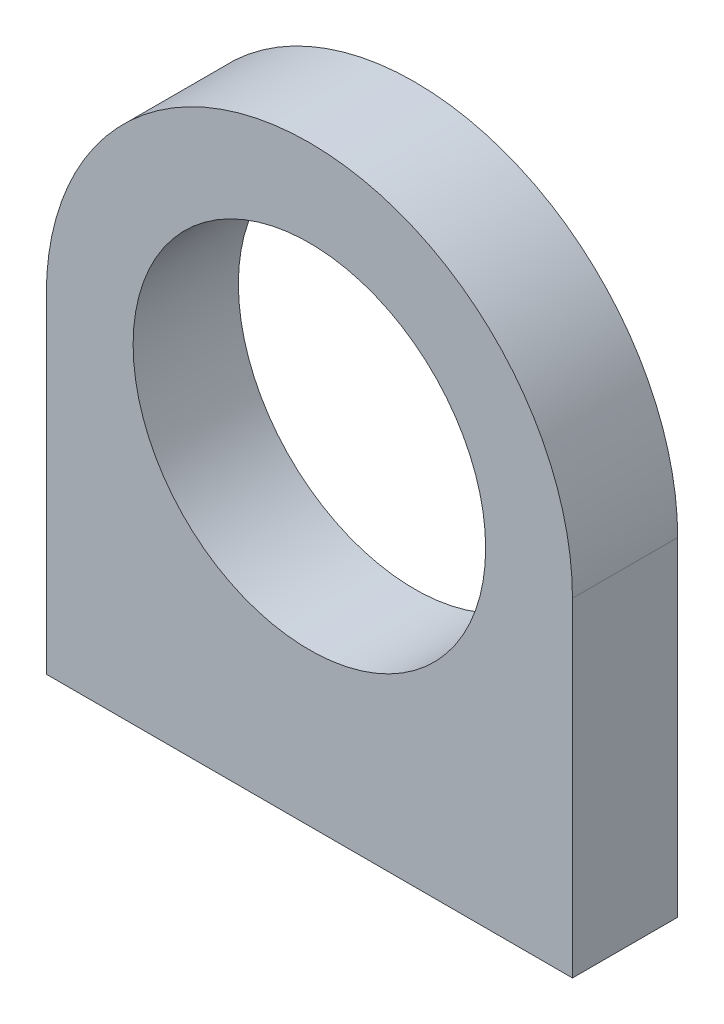
ISO-10303-21;
HEADER;
FILE_DESCRIPTION(('STEP AP214'),'2;1');
FILE_NAME('part.step','',(''),(''),'','','');
FILE_SCHEMA(('AUTOMOTIVE_DESIGN { 1 0 10303 214 1 1 1 1 }'));
ENDSEC;
DATA;
#1=APPLICATION_CONTEXT('core data for automotive mechanical design processes');
#2=APPLICATION_PROTOCOL_DEFINITION('international standard','automotive_design',2000,#1);
#3=PRODUCT_CONTEXT('',#1,'mechanical');
#4=PRODUCT('Part','Part','',(#3));
#5=PRODUCT_RELATED_PRODUCT_CATEGORY('part','',(#4));
#6=PRODUCT_DEFINITION_FORMATION('','',#4);
#7=PRODUCT_DEFINITION_CONTEXT('part definition',#1,'design');
#8=PRODUCT_DEFINITION('design','',#6,#7);
#9=PRODUCT_DEFINITION_SHAPE('','',#8);
#10=(LENGTH_UNIT() NAMED_UNIT(*) SI_UNIT(.MILLI.,.METRE.));
#11=(NAMED_UNIT(*) PLANE_ANGLE_UNIT() SI_UNIT($,.RADIAN.));
#12=(NAMED_UNIT(*) SI_UNIT($,.STERADIAN.) SOLID_ANGLE_UNIT());
#13=UNCERTAINTY_MEASURE_WITH_UNIT(LENGTH_MEASURE(1.E-05),#10,'distance_accuracy_value','');
#14=(GEOMETRIC_REPRESENTATION_CONTEXT(3) GLOBAL_UNCERTAINTY_ASSIGNED_CONTEXT((#13)) GLOBAL_UNIT_ASSIGNED_CONTEXT((#10,
#11,#12)) REPRESENTATION_CONTEXT('',''));
#15=CARTESIAN_POINT('',(0.,0.,0.));
#16=DIRECTION('',(0.,0.,1.));
#17=DIRECTION('',(1.,0.,0.));
#18=AXIS2_PLACEMENT_3D('',#15,#16,#17);
#19=CARTESIAN_POINT('',(0.,0.,8.));
#20=DIRECTION('',(0.,0.,-1.));
#21=DIRECTION('',(-1.,0.,0.));
#22=AXIS2_PLACEMENT_3D('',#19,#20,#21);
#23=PLANE('',#22);
#24=CARTESIAN_POINT('',(0.,0.,8.));
#25=DIRECTION('',(0.,0.,1.));
#26=DIRECTION('',(1.,0.,0.));
#27=AXIS2_PLACEMENT_3D('',#24,#25,#26);
#28=CIRCLE('',#27,13.4);
#29=CARTESIAN_POINT('',(13.4,0.,8.));
#30=VERTEX_POINT('',#29);
#31=EDGE_CURVE('E148',#30,#30,#28,.T.);
#32=ORIENTED_EDGE('',*,*,#31,.F.);
#33=EDGE_LOOP('',(#32));
#34=FACE_BOUND('',#33,.T.);
#35=CARTESIAN_POINT('',(0.,0.,8.));
#36=DIRECTION('',(0.,0.,1.));
#37=DIRECTION('',(-1.,0.,0.));
#38=AXIS2_PLACEMENT_3D('',#35,#36,#37);
#39=CIRCLE('',#38,20.);
#40=CARTESIAN_POINT('',(20.,0.,8.));
#41=VERTEX_POINT('',#40);
#42=CARTESIAN_POINT('',(-20.,0.,8.));
#43=VERTEX_POINT('',#42);
#44=EDGE_CURVE('E94',#41,#43,#39,.T.);
#45=ORIENTED_EDGE('',*,*,#44,.T.);
#46=DIRECTION('',(0.,-1.,0.));
#47=VECTOR('',#46,1.);
#48=CARTESIAN_POINT('',(-20.,0.,8.));
#49=LINE('',#48,#47);
#50=CARTESIAN_POINT('',(-20.,-25.,8.));
#51=VERTEX_POINT('',#50);
#52=EDGE_CURVE('E90',#43,#51,#49,.T.);
#53=ORIENTED_EDGE('',*,*,#52,.T.);
#54=DIRECTION('',(1.,0.,0.));
#55=VECTOR('',#54,1.);
#56=CARTESIAN_POINT('',(-20.,-25.,8.));
#57=LINE('',#56,#55);
#58=CARTESIAN_POINT('',(20.,-25.,8.));
#59=VERTEX_POINT('',#58);
#60=EDGE_CURVE('E92',#51,#59,#57,.T.);
#61=ORIENTED_EDGE('',*,*,#60,.T.);
#62=DIRECTION('',(0.,1.,0.));
#63=VECTOR('',#62,1.);
#64=CARTESIAN_POINT('',(20.,0.,8.));
#65=LINE('',#64,#63);
#66=EDGE_CURVE('E59',#59,#41,#65,.T.);
#67=ORIENTED_EDGE('',*,*,#66,.T.);
#68=EDGE_LOOP('',(#45,#53,#61,#67));
#69=FACE_BOUND('',#68,.T.);
#70=ADVANCED_FACE('F41',(#34,#69),#23,.F.);
#71=CARTESIAN_POINT('',(0.,0.,0.));
#72=DIRECTION('',(0.,0.,-1.));
#73=DIRECTION('',(-1.,0.,0.));
#74=AXIS2_PLACEMENT_3D('',#71,#72,#73);
#75=PLANE('',#74);
#76=CARTESIAN_POINT('',(0.,0.,0.));
#77=DIRECTION('',(0.,0.,1.));
#78=DIRECTION('',(1.,0.,0.));
#79=AXIS2_PLACEMENT_3D('',#76,#77,#78);
#80=CIRCLE('',#79,13.4);
#81=CARTESIAN_POINT('',(13.4,0.,0.));
#82=VERTEX_POINT('',#81);
#83=EDGE_CURVE('E112',#82,#82,#80,.T.);
#84=ORIENTED_EDGE('',*,*,#83,.T.);
#85=EDGE_LOOP('',(#84));
#86=FACE_BOUND('',#85,.T.);
#87=CARTESIAN_POINT('',(0.,0.,0.));
#88=DIRECTION('',(0.,0.,1.));
#89=DIRECTION('',(-1.,0.,0.));
#90=AXIS2_PLACEMENT_3D('',#87,#88,#89);
#91=CIRCLE('',#90,20.);
#92=CARTESIAN_POINT('',(20.,0.,0.));
#93=VERTEX_POINT('',#92);
#94=CARTESIAN_POINT('',(-20.,0.,0.));
#95=VERTEX_POINT('',#94);
#96=EDGE_CURVE('E109',#93,#95,#91,.T.);
#97=ORIENTED_EDGE('',*,*,#96,.F.);
#98=DIRECTION('',(0.,1.,0.));
#99=VECTOR('',#98,1.);
#100=CARTESIAN_POINT('',(20.,0.,0.));
#101=LINE('',#100,#99);
#102=CARTESIAN_POINT('',(20.,-25.,0.));
#103=VERTEX_POINT('',#102);
#104=EDGE_CURVE('E82',#103,#93,#101,.T.);
#105=ORIENTED_EDGE('',*,*,#104,.F.);
#106=DIRECTION('',(1.,0.,0.));
#107=VECTOR('',#106,1.);
#108=CARTESIAN_POINT('',(-20.,-25.,0.));
#109=LINE('',#108,#107);
#110=CARTESIAN_POINT('',(-20.,-25.,0.));
#111=VERTEX_POINT('',#110);
#112=EDGE_CURVE('E76',#111,#103,#109,.T.);
#113=ORIENTED_EDGE('',*,*,#112,.F.);
#114=DIRECTION('',(0.,-1.,0.));
#115=VECTOR('',#114,1.);
#116=CARTESIAN_POINT('',(-20.,0.,0.));
#117=LINE('',#116,#115);
#118=EDGE_CURVE('E99',#95,#111,#117,.T.);
#119=ORIENTED_EDGE('',*,*,#118,.F.);
#120=EDGE_LOOP('',(#97,#105,#113,#119));
#121=FACE_BOUND('',#120,.T.);
#122=ADVANCED_FACE('F158',(#86,#121),#75,.T.);
#123=CARTESIAN_POINT('',(0.,0.,8.));
#124=DIRECTION('',(0.,0.,-1.));
#125=DIRECTION('',(-1.,0.,0.));
#126=AXIS2_PLACEMENT_3D('',#123,#124,#125);
#127=CYLINDRICAL_SURFACE('',#126,20.);
#128=ORIENTED_EDGE('',*,*,#96,.T.);
#129=DIRECTION('',(0.,0.,-1.));
#130=VECTOR('',#129,1.);
#131=CARTESIAN_POINT('',(-20.,0.,8.));
#132=LINE('',#131,#130);
#133=EDGE_CURVE('E100',#43,#95,#132,.T.);
#134=ORIENTED_EDGE('',*,*,#133,.F.);
#135=ORIENTED_EDGE('',*,*,#44,.F.);
#136=DIRECTION('',(0.,0.,-1.));
#137=VECTOR('',#136,1.);
#138=CARTESIAN_POINT('',(20.,0.,8.));
#139=LINE('',#138,#137);
#140=EDGE_CURVE('E105',#41,#93,#139,.T.);
#141=ORIENTED_EDGE('',*,*,#140,.T.);
#142=EDGE_LOOP('',(#128,#134,#135,#141));
#143=FACE_BOUND('',#142,.T.);
#144=ADVANCED_FACE('F163',(#143),#127,.T.);
#145=CARTESIAN_POINT('',(-20.,0.,8.));
#146=DIRECTION('',(1.,0.,0.));
#147=DIRECTION('',(0.,1.,0.));
#148=AXIS2_PLACEMENT_3D('',#145,#146,#147);
#149=PLANE('',#148);
#150=ORIENTED_EDGE('',*,*,#118,.T.);
#151=DIRECTION('',(0.,0.,-1.));
#152=VECTOR('',#151,1.);
#153=CARTESIAN_POINT('',(-20.,-25.,8.));
#154=LINE('',#153,#152);
#155=EDGE_CURVE('E97',#51,#111,#154,.T.);
#156=ORIENTED_EDGE('',*,*,#155,.F.);
#157=ORIENTED_EDGE('',*,*,#52,.F.);
#158=ORIENTED_EDGE('',*,*,#133,.T.);
#159=EDGE_LOOP('',(#150,#156,#157,#158));
#160=FACE_BOUND('',#159,.T.);
#161=ADVANCED_FACE('F98',(#160),#149,.F.);
#162=CARTESIAN_POINT('',(-20.,-25.,8.));
#163=DIRECTION('',(0.,1.,0.));
#164=DIRECTION('',(0.,0.,1.));
#165=AXIS2_PLACEMENT_3D('',#162,#163,#164);
#166=PLANE('',#165);
#167=CARTESIAN_POINT('',(15.,-25.,4.));
#168=DIRECTION('',(0.,1.,0.));
#169=DIRECTION('',(0.,0.,1.));
#170=AXIS2_PLACEMENT_3D('',#167,#168,#169);
#171=CIRCLE('',#170,3.);
#172=CARTESIAN_POINT('',(15.,-25.,7.00000000000001));
#173=VERTEX_POINT('',#172);
#174=EDGE_CURVE('E51',#173,#173,#171,.T.);
#175=ORIENTED_EDGE('',*,*,#174,.T.);
#176=EDGE_LOOP('',(#175));
#177=FACE_BOUND('',#176,.T.);
#178=CARTESIAN_POINT('',(-15.,-25.,4.));
#179=DIRECTION('',(0.,1.,0.));
#180=DIRECTION('',(0.,0.,1.));
#181=AXIS2_PLACEMENT_3D('',#178,#179,#180);
#182=CIRCLE('',#181,3.);
#183=CARTESIAN_POINT('',(-15.,-25.,7.));
#184=VERTEX_POINT('',#183);
#185=EDGE_CURVE('E122',#184,#184,#182,.T.);
#186=ORIENTED_EDGE('',*,*,#185,.T.);
#187=EDGE_LOOP('',(#186));
#188=FACE_BOUND('',#187,.T.);
#189=ORIENTED_EDGE('',*,*,#112,.T.);
#190=DIRECTION('',(0.,0.,-1.));
#191=VECTOR('',#190,1.);
#192=CARTESIAN_POINT('',(20.,-25.,8.));
#193=LINE('',#192,#191);
#194=EDGE_CURVE('E101',#59,#103,#193,.T.);
#195=ORIENTED_EDGE('',*,*,#194,.F.);
#196=ORIENTED_EDGE('',*,*,#60,.F.);
#197=ORIENTED_EDGE('',*,*,#155,.T.);
#198=EDGE_LOOP('',(#189,#195,#196,#197));
#199=FACE_BOUND('',#198,.T.);
#200=ADVANCED_FACE('F103',(#177,#188,#199),#166,.F.);
#201=CARTESIAN_POINT('',(20.,0.,8.));
#202=DIRECTION('',(-1.,0.,0.));
#203=DIRECTION('',(0.,-1.,0.));
#204=AXIS2_PLACEMENT_3D('',#201,#202,#203);
#205=PLANE('',#204);
#206=ORIENTED_EDGE('',*,*,#104,.T.);
#207=ORIENTED_EDGE('',*,*,#140,.F.);
#208=ORIENTED_EDGE('',*,*,#66,.F.);
#209=ORIENTED_EDGE('',*,*,#194,.T.);
#210=EDGE_LOOP('',(#206,#207,#208,#209));
#211=FACE_BOUND('',#210,.T.);
#212=ADVANCED_FACE('F169',(#211),#205,.F.);
#213=CARTESIAN_POINT('',(0.,0.,0.));
#214=DIRECTION('',(0.,0.,1.));
#215=DIRECTION('',(1.,0.,0.));
#216=AXIS2_PLACEMENT_3D('',#213,#214,#215);
#217=CYLINDRICAL_SURFACE('',#216,13.4);
#218=ORIENTED_EDGE('',*,*,#83,.F.);
#219=EDGE_LOOP('',(#218));
#220=FACE_BOUND('',#219,.T.);
#221=ORIENTED_EDGE('',*,*,#31,.T.);
#222=EDGE_LOOP('',(#221));
#223=FACE_BOUND('',#222,.T.);
#224=ADVANCED_FACE('F139',(#220,#223),#217,.F.);
#225=CARTESIAN_POINT('',(15.,-13.,4.));
#226=DIRECTION('',(0.,-1.,0.));
#227=DIRECTION('',(0.,0.,-1.));
#228=AXIS2_PLACEMENT_3D('',#225,#226,#227);
#229=CYLINDRICAL_SURFACE('',#228,2.);
#230=CARTESIAN_POINT('',(15.,-24.,4.));
#231=DIRECTION('',(0.,1.,0.));
#232=DIRECTION('',(0.,0.,1.));
#233=AXIS2_PLACEMENT_3D('',#230,#231,#232);
#234=CIRCLE('',#233,2.);
#235=CARTESIAN_POINT('',(15.,-24.,6.));
#236=VERTEX_POINT('',#235);
#237=EDGE_CURVE('E119',#236,#236,#234,.F.);
#238=ORIENTED_EDGE('',*,*,#237,.T.);
#239=EDGE_LOOP('',(#238));
#240=FACE_BOUND('',#239,.T.);
#241=CARTESIAN_POINT('',(15.,-13.,4.));
#242=DIRECTION('',(0.,-1.,0.));
#243=DIRECTION('',(0.,0.,-1.));
#244=AXIS2_PLACEMENT_3D('',#241,#242,#243);
#245=CIRCLE('',#244,2.);
#246=CARTESIAN_POINT('',(15.,-13.,2.));
#247=VERTEX_POINT('',#246);
#248=EDGE_CURVE('E143',#247,#247,#245,.T.);
#249=ORIENTED_EDGE('',*,*,#248,.F.);
#250=EDGE_LOOP('',(#249));
#251=FACE_BOUND('',#250,.T.);
#252=ADVANCED_FACE('F135',(#240,#251),#229,.F.);
#253=CARTESIAN_POINT('',(15.,-13.,4.));
#254=DIRECTION('',(0.,-1.,0.));
#255=DIRECTION('',(0.,0.,-1.));
#256=AXIS2_PLACEMENT_3D('',#253,#254,#255);
#257=PLANE('',#256);
#258=ORIENTED_EDGE('',*,*,#248,.T.);
#259=EDGE_LOOP('',(#258));
#260=FACE_BOUND('',#259,.T.);
#261=ADVANCED_FACE('F138',(#260),#257,.T.);
#262=CARTESIAN_POINT('',(-15.,-13.,4.));
#263=DIRECTION('',(0.,-1.,0.));
#264=DIRECTION('',(0.,0.,-1.));
#265=AXIS2_PLACEMENT_3D('',#262,#263,#264);
#266=CYLINDRICAL_SURFACE('',#265,2.);
#267=CARTESIAN_POINT('',(-15.,-24.,4.));
#268=DIRECTION('',(0.,1.,0.));
#269=DIRECTION('',(0.,0.,1.));
#270=AXIS2_PLACEMENT_3D('',#267,#268,#269);
#271=CIRCLE('',#270,2.);
#272=CARTESIAN_POINT('',(-15.,-24.,6.));
#273=VERTEX_POINT('',#272);
#274=EDGE_CURVE('E11',#273,#273,#271,.F.);
#275=ORIENTED_EDGE('',*,*,#274,.T.);
#276=EDGE_LOOP('',(#275));
#277=FACE_BOUND('',#276,.T.);
#278=CARTESIAN_POINT('',(-15.,-13.,4.));
#279=DIRECTION('',(0.,-1.,0.));
#280=DIRECTION('',(0.,0.,-1.));
#281=AXIS2_PLACEMENT_3D('',#278,#279,#280);
#282=CIRCLE('',#281,2.);
#283=CARTESIAN_POINT('',(-15.,-13.,2.));
#284=VERTEX_POINT('',#283);
#285=EDGE_CURVE('E145',#284,#284,#282,.T.);
#286=ORIENTED_EDGE('',*,*,#285,.F.);
#287=EDGE_LOOP('',(#286));
#288=FACE_BOUND('',#287,.T.);
#289=ADVANCED_FACE('F219',(#277,#288),#266,.F.);
#290=CARTESIAN_POINT('',(-15.,-13.,4.));
#291=DIRECTION('',(0.,-1.,0.));
#292=DIRECTION('',(0.,0.,-1.));
#293=AXIS2_PLACEMENT_3D('',#290,#291,#292);
#294=PLANE('',#293);
#295=ORIENTED_EDGE('',*,*,#285,.T.);
#296=EDGE_LOOP('',(#295));
#297=FACE_BOUND('',#296,.T.);
#298=ADVANCED_FACE('F132',(#297),#294,.T.);
#299=CARTESIAN_POINT('',(15.,-24.,4.));
#300=DIRECTION('',(0.,-1.,0.));
#301=DIRECTION('',(0.,0.,-1.));
#302=AXIS2_PLACEMENT_3D('',#299,#300,#301);
#303=CONICAL_SURFACE('',#302,2.,0.785398163397447);
#304=ORIENTED_EDGE('',*,*,#174,.F.);
#305=EDGE_LOOP('',(#304));
#306=FACE_BOUND('',#305,.T.);
#307=ORIENTED_EDGE('',*,*,#237,.F.);
#308=EDGE_LOOP('',(#307));
#309=FACE_BOUND('',#308,.T.);
#310=ADVANCED_FACE('F129',(#306,#309),#303,.F.);
#311=CARTESIAN_POINT('',(-15.,-24.,4.));
#312=DIRECTION('',(0.,-1.,0.));
#313=DIRECTION('',(0.,0.,-1.));
#314=AXIS2_PLACEMENT_3D('',#311,#312,#313);
#315=CONICAL_SURFACE('',#314,2.,0.785398163397447);
#316=ORIENTED_EDGE('',*,*,#185,.F.);
#317=EDGE_LOOP('',(#316));
#318=FACE_BOUND('',#317,.T.);
#319=ORIENTED_EDGE('',*,*,#274,.F.);
#320=EDGE_LOOP('',(#319));
#321=FACE_BOUND('',#320,.T.);
#322=ADVANCED_FACE('F44',(#318,#321),#315,.F.);
#323=CLOSED_SHELL('',(#70,#122,#144,#161,#200,#212,#224,#252,#261,#289,#298,#310,#322));
#324=MANIFOLD_SOLID_BREP('B2',#323);
#325=ADVANCED_BREP_SHAPE_REPRESENTATION('',(#18,#324),#14);
#326=SHAPE_DEFINITION_REPRESENTATION(#9,#325);
ENDSEC;
END-ISO-10303-21;
